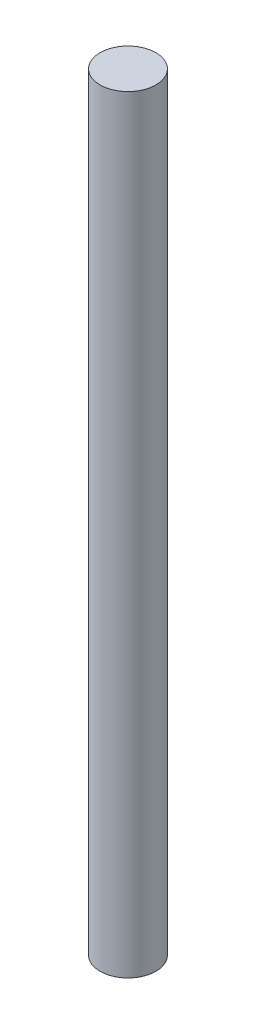
ISO-10303-21;
HEADER;
FILE_DESCRIPTION(('STEP AP214'),'2;1');
FILE_NAME('part.step','',(''),(''),'','','');
FILE_SCHEMA(('AUTOMOTIVE_DESIGN { 1 0 10303 214 1 1 1 1 }'));
ENDSEC;
DATA;
#1=APPLICATION_CONTEXT('core data for automotive mechanical design processes');
#2=APPLICATION_PROTOCOL_DEFINITION('international standard','automotive_design',2000,#1);
#3=PRODUCT_CONTEXT('',#1,'mechanical');
#4=PRODUCT('Part','Part','',(#3));
#5=PRODUCT_RELATED_PRODUCT_CATEGORY('part','',(#4));
#6=PRODUCT_DEFINITION_FORMATION('','',#4);
#7=PRODUCT_DEFINITION_CONTEXT('part definition',#1,'design');
#8=PRODUCT_DEFINITION('design','',#6,#7);
#9=PRODUCT_DEFINITION_SHAPE('','',#8);
#10=(LENGTH_UNIT() NAMED_UNIT(*) SI_UNIT(.MILLI.,.METRE.));
#11=(NAMED_UNIT(*) PLANE_ANGLE_UNIT() SI_UNIT($,.RADIAN.));
#12=(NAMED_UNIT(*) SI_UNIT($,.STERADIAN.) SOLID_ANGLE_UNIT());
#13=UNCERTAINTY_MEASURE_WITH_UNIT(LENGTH_MEASURE(1.E-05),#10,'distance_accuracy_value','');
#14=(GEOMETRIC_REPRESENTATION_CONTEXT(3) GLOBAL_UNCERTAINTY_ASSIGNED_CONTEXT((#13)) GLOBAL_UNIT_ASSIGNED_CONTEXT((#10,
#11,#12)) REPRESENTATION_CONTEXT('',''));
#15=CARTESIAN_POINT('',(0.,0.,0.));
#16=DIRECTION('',(0.,0.,1.));
#17=DIRECTION('',(1.,0.,0.));
#18=AXIS2_PLACEMENT_3D('',#15,#16,#17);
#19=CARTESIAN_POINT('',(0.,110.,0.));
#20=DIRECTION('',(0.,-1.,0.));
#21=DIRECTION('',(0.,0.,-1.));
#22=AXIS2_PLACEMENT_3D('',#19,#20,#21);
#23=CYLINDRICAL_SURFACE('',#22,4.);
#24=CARTESIAN_POINT('',(0.,110.,0.));
#25=DIRECTION('',(0.,1.,0.));
#26=DIRECTION('',(0.,0.,1.));
#27=AXIS2_PLACEMENT_3D('',#24,#25,#26);
#28=CIRCLE('',#27,4.);
#29=CARTESIAN_POINT('',(0.,110.,4.));
#30=VERTEX_POINT('',#29);
#31=EDGE_CURVE('E10',#30,#30,#28,.T.);
#32=ORIENTED_EDGE('',*,*,#31,.F.);
#33=EDGE_LOOP('',(#32));
#34=FACE_BOUND('',#33,.T.);
#35=CARTESIAN_POINT('',(0.,0.,0.));
#36=DIRECTION('',(0.,1.,0.));
#37=DIRECTION('',(0.,0.,1.));
#38=AXIS2_PLACEMENT_3D('',#35,#36,#37);
#39=CIRCLE('',#38,4.);
#40=CARTESIAN_POINT('',(0.,0.,4.));
#41=VERTEX_POINT('',#40);
#42=EDGE_CURVE('E37',#41,#41,#39,.T.);
#43=ORIENTED_EDGE('',*,*,#42,.T.);
#44=EDGE_LOOP('',(#43));
#45=FACE_BOUND('',#44,.T.);
#46=ADVANCED_FACE('F34',(#34,#45),#23,.T.);
#47=CARTESIAN_POINT('',(0.,110.,0.));
#48=DIRECTION('',(0.,1.,0.));
#49=DIRECTION('',(0.,0.,1.));
#50=AXIS2_PLACEMENT_3D('',#47,#48,#49);
#51=PLANE('',#50);
#52=ORIENTED_EDGE('',*,*,#31,.T.);
#53=EDGE_LOOP('',(#52));
#54=FACE_BOUND('',#53,.T.);
#55=ADVANCED_FACE('F49',(#54),#51,.T.);
#56=CARTESIAN_POINT('',(0.,0.,0.));
#57=DIRECTION('',(0.,1.,0.));
#58=DIRECTION('',(0.,0.,1.));
#59=AXIS2_PLACEMENT_3D('',#56,#57,#58);
#60=PLANE('',#59);
#61=ORIENTED_EDGE('',*,*,#42,.F.);
#62=EDGE_LOOP('',(#61));
#63=FACE_BOUND('',#62,.T.);
#64=ADVANCED_FACE('F47',(#63),#60,.F.);
#65=CLOSED_SHELL('',(#46,#55,#64));
#66=MANIFOLD_SOLID_BREP('B2',#65);
#67=ADVANCED_BREP_SHAPE_REPRESENTATION('',(#18,#66),#14);
#68=SHAPE_DEFINITION_REPRESENTATION(#9,#67);
ENDSEC;
END-ISO-10303-21;
